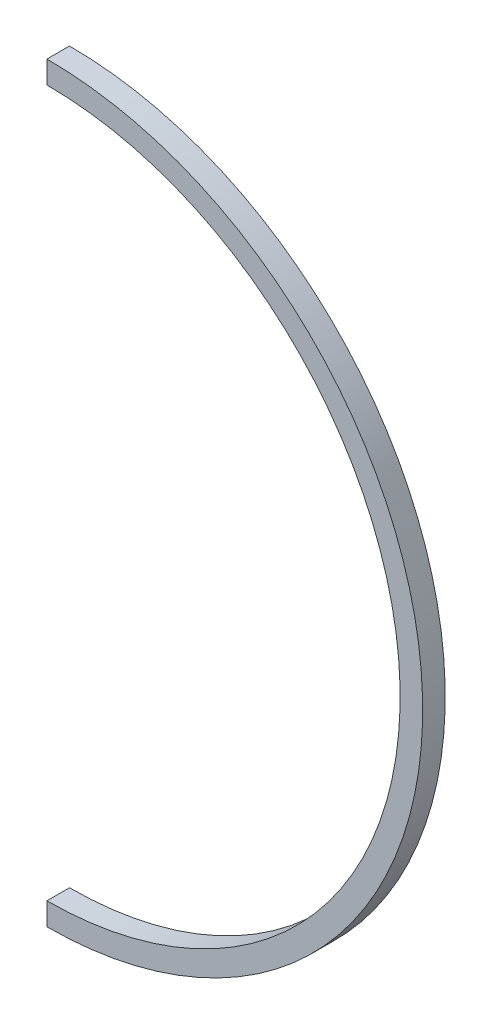
ISO-10303-21;
HEADER;
FILE_DESCRIPTION(('STEP AP214'),'2;1');
FILE_NAME('part.step','',(''),(''),'','','');
FILE_SCHEMA(('AUTOMOTIVE_DESIGN { 1 0 10303 214 1 1 1 1 }'));
ENDSEC;
DATA;
#1=APPLICATION_CONTEXT('core data for automotive mechanical design processes');
#2=APPLICATION_PROTOCOL_DEFINITION('international standard','automotive_design',2000,#1);
#3=PRODUCT_CONTEXT('',#1,'mechanical');
#4=PRODUCT('Part','Part','',(#3));
#5=PRODUCT_RELATED_PRODUCT_CATEGORY('part','',(#4));
#6=PRODUCT_DEFINITION_FORMATION('','',#4);
#7=PRODUCT_DEFINITION_CONTEXT('part definition',#1,'design');
#8=PRODUCT_DEFINITION('design','',#6,#7);
#9=PRODUCT_DEFINITION_SHAPE('','',#8);
#10=(LENGTH_UNIT() NAMED_UNIT(*) SI_UNIT(.MILLI.,.METRE.));
#11=(NAMED_UNIT(*) PLANE_ANGLE_UNIT() SI_UNIT($,.RADIAN.));
#12=(NAMED_UNIT(*) SI_UNIT($,.STERADIAN.) SOLID_ANGLE_UNIT());
#13=UNCERTAINTY_MEASURE_WITH_UNIT(LENGTH_MEASURE(1.E-05),#10,'distance_accuracy_value','');
#14=(GEOMETRIC_REPRESENTATION_CONTEXT(3) GLOBAL_UNCERTAINTY_ASSIGNED_CONTEXT((#13)) GLOBAL_UNIT_ASSIGNED_CONTEXT((#10,
#11,#12)) REPRESENTATION_CONTEXT('',''));
#15=CARTESIAN_POINT('',(0.,0.,0.));
#16=DIRECTION('',(0.,0.,1.));
#17=DIRECTION('',(1.,0.,0.));
#18=AXIS2_PLACEMENT_3D('',#15,#16,#17);
#19=CARTESIAN_POINT('',(0.,0.,3.));
#20=DIRECTION('',(0.,0.,1.));
#21=DIRECTION('',(1.,0.,0.));
#22=AXIS2_PLACEMENT_3D('',#19,#20,#21);
#23=PLANE('',#22);
#24=DIRECTION('',(0.,1.,0.));
#25=VECTOR('',#24,1.);
#26=CARTESIAN_POINT('',(300.,1.71683972880179E-13,3.));
#27=LINE('',#26,#25);
#28=CARTESIAN_POINT('',(300.,47.,3.));
#29=VERTEX_POINT('',#28);
#30=CARTESIAN_POINT('',(300.,50.,3.));
#31=VERTEX_POINT('',#30);
#32=EDGE_CURVE('E79',#29,#31,#27,.T.);
#33=ORIENTED_EDGE('',*,*,#32,.F.);
#34=CARTESIAN_POINT('',(300.,0.,3.));
#35=DIRECTION('',(0.,0.,1.));
#36=DIRECTION('',(1.,0.,0.));
#37=AXIS2_PLACEMENT_3D('',#34,#35,#36);
#38=CIRCLE('',#37,47.);
#39=CARTESIAN_POINT('',(300.,-47.,3.));
#40=VERTEX_POINT('',#39);
#41=EDGE_CURVE('E86',#29,#40,#38,.F.);
#42=ORIENTED_EDGE('',*,*,#41,.T.);
#43=DIRECTION('',(0.,1.,0.));
#44=VECTOR('',#43,1.);
#45=CARTESIAN_POINT('',(300.,1.71683972880179E-13,3.));
#46=LINE('',#45,#44);
#47=CARTESIAN_POINT('',(300.,-50.,3.));
#48=VERTEX_POINT('',#47);
#49=EDGE_CURVE('E85',#48,#40,#46,.T.);
#50=ORIENTED_EDGE('',*,*,#49,.F.);
#51=CARTESIAN_POINT('',(300.,0.,3.));
#52=DIRECTION('',(0.,0.,1.));
#53=DIRECTION('',(1.,0.,0.));
#54=AXIS2_PLACEMENT_3D('',#51,#52,#53);
#55=CIRCLE('',#54,50.);
#56=EDGE_CURVE('E74',#48,#31,#55,.T.);
#57=ORIENTED_EDGE('',*,*,#56,.T.);
#58=EDGE_LOOP('',(#33,#42,#50,#57));
#59=FACE_BOUND('',#58,.T.);
#60=ADVANCED_FACE('F32',(#59),#23,.T.);
#61=CARTESIAN_POINT('',(300.,1.71683972880179E-13,0.));
#62=DIRECTION('',(-1.,0.,0.));
#63=DIRECTION('',(0.,-1.,0.));
#64=AXIS2_PLACEMENT_3D('',#61,#62,#63);
#65=PLANE('',#64);
#66=DIRECTION('',(0.,0.,1.));
#67=VECTOR('',#66,1.);
#68=CARTESIAN_POINT('',(300.,47.,3.));
#69=LINE('',#68,#67);
#70=CARTESIAN_POINT('',(300.,47.,0.));
#71=VERTEX_POINT('',#70);
#72=EDGE_CURVE('E11',#71,#29,#69,.T.);
#73=ORIENTED_EDGE('',*,*,#72,.T.);
#74=ORIENTED_EDGE('',*,*,#32,.T.);
#75=DIRECTION('',(0.,0.,-1.));
#76=VECTOR('',#75,1.);
#77=CARTESIAN_POINT('',(300.,50.,60.));
#78=LINE('',#77,#76);
#79=CARTESIAN_POINT('',(300.,50.,0.));
#80=VERTEX_POINT('',#79);
#81=EDGE_CURVE('E40',#31,#80,#78,.T.);
#82=ORIENTED_EDGE('',*,*,#81,.T.);
#83=DIRECTION('',(0.,-1.,0.));
#84=VECTOR('',#83,1.);
#85=CARTESIAN_POINT('',(300.,3.43367945760358E-13,0.));
#86=LINE('',#85,#84);
#87=EDGE_CURVE('E97',#80,#71,#86,.T.);
#88=ORIENTED_EDGE('',*,*,#87,.T.);
#89=EDGE_LOOP('',(#73,#74,#82,#88));
#90=FACE_BOUND('',#89,.T.);
#91=ADVANCED_FACE('F80',(#90),#65,.T.);
#92=DIRECTION('',(0.,0.,-1.));
#93=VECTOR('',#92,1.);
#94=CARTESIAN_POINT('',(300.,-50.,60.));
#95=LINE('',#94,#93);
#96=CARTESIAN_POINT('',(300.,-50.,0.));
#97=VERTEX_POINT('',#96);
#98=EDGE_CURVE('E95',#48,#97,#95,.T.);
#99=ORIENTED_EDGE('',*,*,#98,.F.);
#100=ORIENTED_EDGE('',*,*,#49,.T.);
#101=DIRECTION('',(0.,0.,1.));
#102=VECTOR('',#101,1.);
#103=CARTESIAN_POINT('',(300.,-47.,3.));
#104=LINE('',#103,#102);
#105=CARTESIAN_POINT('',(300.,-47.,0.));
#106=VERTEX_POINT('',#105);
#107=EDGE_CURVE('E93',#106,#40,#104,.T.);
#108=ORIENTED_EDGE('',*,*,#107,.F.);
#109=EDGE_CURVE('E77',#106,#97,#86,.T.);
#110=ORIENTED_EDGE('',*,*,#109,.T.);
#111=EDGE_LOOP('',(#99,#100,#108,#110));
#112=FACE_BOUND('',#111,.T.);
#113=ADVANCED_FACE('F103',(#112),#65,.T.);
#114=CARTESIAN_POINT('',(300.,0.,3.));
#115=DIRECTION('',(0.,0.,1.));
#116=DIRECTION('',(1.,0.,0.));
#117=AXIS2_PLACEMENT_3D('',#114,#115,#116);
#118=CYLINDRICAL_SURFACE('',#117,47.);
#119=ORIENTED_EDGE('',*,*,#41,.F.);
#120=ORIENTED_EDGE('',*,*,#72,.F.);
#121=CARTESIAN_POINT('',(300.,0.,0.));
#122=DIRECTION('',(0.,0.,-1.));
#123=DIRECTION('',(-1.,0.,0.));
#124=AXIS2_PLACEMENT_3D('',#121,#122,#123);
#125=CIRCLE('',#124,47.);
#126=EDGE_CURVE('E54',#71,#106,#125,.T.);
#127=ORIENTED_EDGE('',*,*,#126,.T.);
#128=ORIENTED_EDGE('',*,*,#107,.T.);
#129=EDGE_LOOP('',(#119,#120,#127,#128));
#130=FACE_BOUND('',#129,.T.);
#131=ADVANCED_FACE('F34',(#130),#118,.F.);
#132=CARTESIAN_POINT('',(300.,0.,60.));
#133=DIRECTION('',(0.,0.,-1.));
#134=DIRECTION('',(-1.,0.,0.));
#135=AXIS2_PLACEMENT_3D('',#132,#133,#134);
#136=CYLINDRICAL_SURFACE('',#135,50.);
#137=ORIENTED_EDGE('',*,*,#56,.F.);
#138=ORIENTED_EDGE('',*,*,#98,.T.);
#139=CARTESIAN_POINT('',(300.,0.,0.));
#140=DIRECTION('',(0.,0.,1.));
#141=DIRECTION('',(1.,0.,0.));
#142=AXIS2_PLACEMENT_3D('',#139,#140,#141);
#143=CIRCLE('',#142,50.);
#144=EDGE_CURVE('E76',#97,#80,#143,.T.);
#145=ORIENTED_EDGE('',*,*,#144,.T.);
#146=ORIENTED_EDGE('',*,*,#81,.F.);
#147=EDGE_LOOP('',(#137,#138,#145,#146));
#148=FACE_BOUND('',#147,.T.);
#149=ADVANCED_FACE('F72',(#148),#136,.T.);
#150=CARTESIAN_POINT('',(-300.,0.,0.));
#151=DIRECTION('',(0.,0.,1.));
#152=DIRECTION('',(1.,0.,0.));
#153=AXIS2_PLACEMENT_3D('',#150,#151,#152);
#154=PLANE('',#153);
#155=ORIENTED_EDGE('',*,*,#87,.F.);
#156=ORIENTED_EDGE('',*,*,#144,.F.);
#157=ORIENTED_EDGE('',*,*,#109,.F.);
#158=ORIENTED_EDGE('',*,*,#126,.F.);
#159=EDGE_LOOP('',(#155,#156,#157,#158));
#160=FACE_BOUND('',#159,.T.);
#161=ADVANCED_FACE('F110',(#160),#154,.F.);
#162=CLOSED_SHELL('',(#60,#91,#113,#131,#149,#161));
#163=MANIFOLD_SOLID_BREP('B2',#162);
#164=ADVANCED_BREP_SHAPE_REPRESENTATION('',(#18,#163),#14);
#165=SHAPE_DEFINITION_REPRESENTATION(#9,#164);
ENDSEC;
END-ISO-10303-21;
